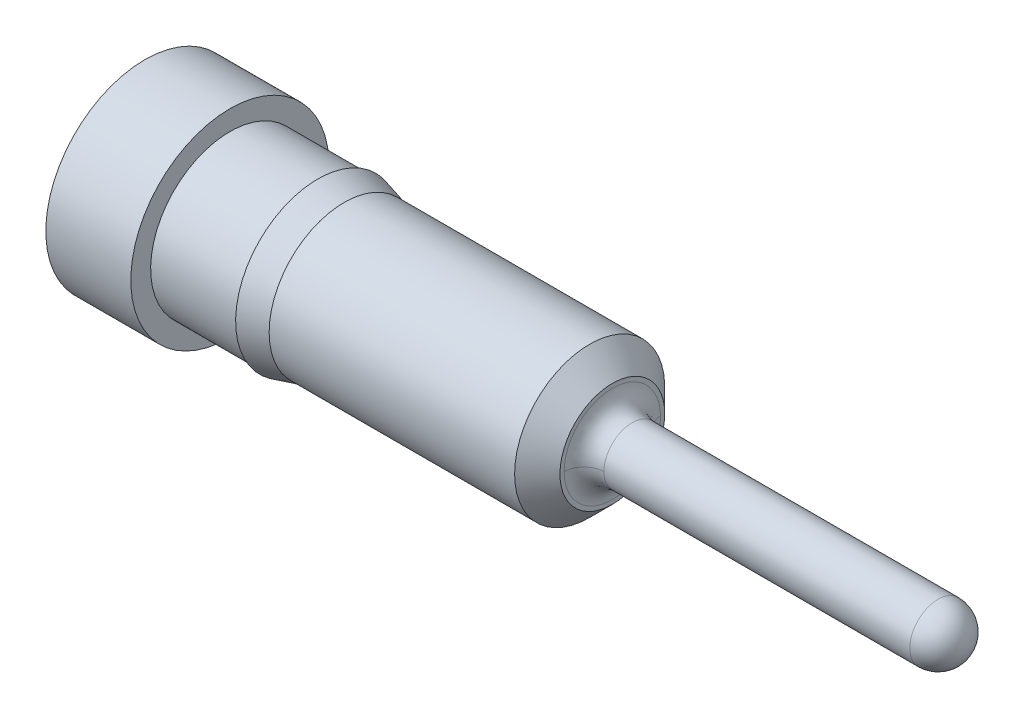
ISO-10303-21;
HEADER;
FILE_DESCRIPTION(('STEP AP214'),'2;1');
FILE_NAME('part.step','',(''),(''),'','','');
FILE_SCHEMA(('AUTOMOTIVE_DESIGN { 1 0 10303 214 1 1 1 1 }'));
ENDSEC;
DATA;
#1=APPLICATION_CONTEXT('core data for automotive mechanical design processes');
#2=APPLICATION_PROTOCOL_DEFINITION('international standard','automotive_design',2000,#1);
#3=PRODUCT_CONTEXT('',#1,'mechanical');
#4=PRODUCT('Part','Part','',(#3));
#5=PRODUCT_RELATED_PRODUCT_CATEGORY('part','',(#4));
#6=PRODUCT_DEFINITION_FORMATION('','',#4);
#7=PRODUCT_DEFINITION_CONTEXT('part definition',#1,'design');
#8=PRODUCT_DEFINITION('design','',#6,#7);
#9=PRODUCT_DEFINITION_SHAPE('','',#8);
#10=(LENGTH_UNIT() NAMED_UNIT(*) SI_UNIT(.MILLI.,.METRE.));
#11=(NAMED_UNIT(*) PLANE_ANGLE_UNIT() SI_UNIT($,.RADIAN.));
#12=(NAMED_UNIT(*) SI_UNIT($,.STERADIAN.) SOLID_ANGLE_UNIT());
#13=UNCERTAINTY_MEASURE_WITH_UNIT(LENGTH_MEASURE(1.E-05),#10,'distance_accuracy_value','');
#14=(GEOMETRIC_REPRESENTATION_CONTEXT(3) GLOBAL_UNCERTAINTY_ASSIGNED_CONTEXT((#13)) GLOBAL_UNIT_ASSIGNED_CONTEXT((#10,
#11,#12)) REPRESENTATION_CONTEXT('',''));
#15=CARTESIAN_POINT('',(0.,0.,0.));
#16=DIRECTION('',(0.,0.,1.));
#17=DIRECTION('',(1.,0.,0.));
#18=AXIS2_PLACEMENT_3D('',#15,#16,#17);
#19=CARTESIAN_POINT('',(0.,-0.899668,0.899668));
#20=DIRECTION('',(1.,0.,0.));
#21=DIRECTION('',(0.,0.,-1.));
#22=AXIS2_PLACEMENT_3D('',#19,#20,#21);
#23=PLANE('',#22);
#24=CARTESIAN_POINT('',(0.,0.,0.));
#25=DIRECTION('',(-1.,0.,0.));
#26=DIRECTION('',(0.,-1.,0.));
#27=AXIS2_PLACEMENT_3D('',#24,#25,#26);
#28=CIRCLE('',#27,0.889);
#29=CARTESIAN_POINT('',(0.,-0.889,0.));
#30=VERTEX_POINT('',#29);
#31=EDGE_CURVE('E21',#30,#30,#28,.T.);
#32=ORIENTED_EDGE('',*,*,#31,.T.);
#33=EDGE_LOOP('',(#32));
#34=FACE_BOUND('',#33,.T.);
#35=ADVANCED_FACE('F16',(#34),#23,.F.);
#36=CARTESIAN_POINT('',(0.762,0.,0.));
#37=DIRECTION('',(-1.,0.,0.));
#38=DIRECTION('',(0.,-1.,0.));
#39=AXIS2_PLACEMENT_3D('',#36,#37,#38);
#40=CYLINDRICAL_SURFACE('',#39,0.889);
#41=ORIENTED_EDGE('',*,*,#31,.F.);
#42=EDGE_LOOP('',(#41));
#43=FACE_BOUND('',#42,.T.);
#44=CARTESIAN_POINT('',(0.762,0.,0.));
#45=DIRECTION('',(-1.,0.,0.));
#46=DIRECTION('',(0.,-1.,0.));
#47=AXIS2_PLACEMENT_3D('',#44,#45,#46);
#48=CIRCLE('',#47,0.889);
#49=CARTESIAN_POINT('',(0.762,-0.889,0.));
#50=VERTEX_POINT('',#49);
#51=EDGE_CURVE('E182',#50,#50,#48,.T.);
#52=ORIENTED_EDGE('',*,*,#51,.T.);
#53=EDGE_LOOP('',(#52));
#54=FACE_BOUND('',#53,.T.);
#55=ADVANCED_FACE('F92',(#43,#54),#40,.T.);
#56=CARTESIAN_POINT('',(0.762,-0.899668,-0.899668));
#57=DIRECTION('',(-1.,0.,0.));
#58=DIRECTION('',(0.,0.,1.));
#59=AXIS2_PLACEMENT_3D('',#56,#57,#58);
#60=PLANE('',#59);
#61=CARTESIAN_POINT('',(0.762,0.,0.));
#62=DIRECTION('',(-1.,0.,0.));
#63=DIRECTION('',(0.,-1.,0.));
#64=AXIS2_PLACEMENT_3D('',#61,#62,#63);
#65=CIRCLE('',#64,0.7112);
#66=CARTESIAN_POINT('',(0.762,-0.7112,0.));
#67=VERTEX_POINT('',#66);
#68=EDGE_CURVE('E177',#67,#67,#65,.T.);
#69=ORIENTED_EDGE('',*,*,#68,.T.);
#70=EDGE_LOOP('',(#69));
#71=FACE_BOUND('',#70,.T.);
#72=ORIENTED_EDGE('',*,*,#51,.F.);
#73=EDGE_LOOP('',(#72));
#74=FACE_BOUND('',#73,.T.);
#75=ADVANCED_FACE('F90',(#71,#74),#60,.F.);
#76=CARTESIAN_POINT('',(1.5494,0.,0.));
#77=DIRECTION('',(-1.,0.,0.));
#78=DIRECTION('',(0.,-1.,0.));
#79=AXIS2_PLACEMENT_3D('',#76,#77,#78);
#80=CYLINDRICAL_SURFACE('',#79,0.7112);
#81=ORIENTED_EDGE('',*,*,#68,.F.);
#82=EDGE_LOOP('',(#81));
#83=FACE_BOUND('',#82,.T.);
#84=CARTESIAN_POINT('',(1.5494,0.,0.));
#85=DIRECTION('',(-1.,0.,0.));
#86=DIRECTION('',(0.,-1.,0.));
#87=AXIS2_PLACEMENT_3D('',#84,#85,#86);
#88=CIRCLE('',#87,0.7112);
#89=CARTESIAN_POINT('',(1.5494,-0.7112,0.));
#90=VERTEX_POINT('',#89);
#91=EDGE_CURVE('E173',#90,#90,#88,.T.);
#92=ORIENTED_EDGE('',*,*,#91,.T.);
#93=EDGE_LOOP('',(#92));
#94=FACE_BOUND('',#93,.T.);
#95=ADVANCED_FACE('F87',(#83,#94),#80,.T.);
#96=CARTESIAN_POINT('',(1.5494,-0.7454392,0.7454392));
#97=DIRECTION('',(1.,0.,0.));
#98=DIRECTION('',(0.,0.,-1.));
#99=AXIS2_PLACEMENT_3D('',#96,#97,#98);
#100=PLANE('',#99);
#101=ORIENTED_EDGE('',*,*,#91,.F.);
#102=EDGE_LOOP('',(#101));
#103=FACE_BOUND('',#102,.T.);
#104=CARTESIAN_POINT('',(1.54940000000003,0.,0.));
#105=DIRECTION('',(-1.,0.,0.));
#106=DIRECTION('',(0.,-1.,0.));
#107=AXIS2_PLACEMENT_3D('',#104,#105,#106);
#108=CIRCLE('',#107,0.736599999999991);
#109=CARTESIAN_POINT('',(1.54940000000003,-0.736599999999991,0.));
#110=VERTEX_POINT('',#109);
#111=EDGE_CURVE('E169',#110,#110,#108,.T.);
#112=ORIENTED_EDGE('',*,*,#111,.T.);
#113=EDGE_LOOP('',(#112));
#114=FACE_BOUND('',#113,.T.);
#115=ADVANCED_FACE('F85',(#103,#114),#100,.F.);
#116=CARTESIAN_POINT('',(1.7863852258,0.,0.));
#117=DIRECTION('',(-1.,0.,0.));
#118=DIRECTION('',(0.,-1.,0.));
#119=AXIS2_PLACEMENT_3D('',#116,#117,#118);
#120=CONICAL_SURFACE('',#119,0.6731,0.261799388306168);
#121=ORIENTED_EDGE('',*,*,#111,.F.);
#122=EDGE_LOOP('',(#121));
#123=FACE_BOUND('',#122,.T.);
#124=CARTESIAN_POINT('',(1.7863852258,0.,0.));
#125=DIRECTION('',(-1.,0.,0.));
#126=DIRECTION('',(0.,0.,1.));
#127=AXIS2_PLACEMENT_3D('',#124,#125,#126);
#128=CIRCLE('',#127,0.6731);
#129=CARTESIAN_POINT('',(1.7863852258,0.,0.6731));
#130=VERTEX_POINT('',#129);
#131=EDGE_CURVE('E75',#130,#130,#128,.T.);
#132=ORIENTED_EDGE('',*,*,#131,.T.);
#133=EDGE_LOOP('',(#132));
#134=FACE_BOUND('',#133,.T.);
#135=ADVANCED_FACE('F81',(#123,#134),#120,.T.);
#136=CARTESIAN_POINT('',(3.9878,0.,0.));
#137=DIRECTION('',(-1.,0.,0.));
#138=DIRECTION('',(0.,0.,1.));
#139=AXIS2_PLACEMENT_3D('',#136,#137,#138);
#140=CYLINDRICAL_SURFACE('',#139,0.6731);
#141=ORIENTED_EDGE('',*,*,#131,.F.);
#142=EDGE_LOOP('',(#141));
#143=FACE_BOUND('',#142,.T.);
#144=CARTESIAN_POINT('',(3.98779999999999,0.,0.));
#145=DIRECTION('',(-1.,0.,0.));
#146=DIRECTION('',(0.,0.,1.));
#147=AXIS2_PLACEMENT_3D('',#144,#145,#146);
#148=CIRCLE('',#147,0.6731);
#149=CARTESIAN_POINT('',(3.9878,0.,0.6731));
#150=VERTEX_POINT('',#149);
#151=EDGE_CURVE('E63',#150,#150,#148,.T.);
#152=ORIENTED_EDGE('',*,*,#151,.T.);
#153=EDGE_LOOP('',(#152));
#154=FACE_BOUND('',#153,.T.);
#155=ADVANCED_FACE('F56',(#143,#154),#140,.T.);
#156=CARTESIAN_POINT('',(7.112,0.,0.));
#157=DIRECTION('',(-1.,0.,0.));
#158=DIRECTION('',(0.,-1.,0.));
#159=AXIS2_PLACEMENT_3D('',#156,#157,#158);
#160=SPHERICAL_SURFACE('',#159,0.254);
#161=CARTESIAN_POINT('',(7.366,2.54000000000001E-09,0.));
#162=VERTEX_POINT('',#161);
#163=VERTEX_LOOP('',#162);
#164=FACE_BOUND('',#163,.T.);
#165=CARTESIAN_POINT('',(7.112,0.,0.));
#166=DIRECTION('',(-1.,0.,0.));
#167=DIRECTION('',(0.,0.,1.));
#168=AXIS2_PLACEMENT_3D('',#165,#166,#167);
#169=CIRCLE('',#168,0.254);
#170=CARTESIAN_POINT('',(7.112,0.,0.254));
#171=VERTEX_POINT('',#170);
#172=EDGE_CURVE('E60',#171,#171,#169,.F.);
#173=ORIENTED_EDGE('',*,*,#172,.T.);
#174=EDGE_LOOP('',(#173));
#175=FACE_BOUND('',#174,.T.);
#176=ADVANCED_FACE('F52',(#164,#175),#160,.T.);
#177=CARTESIAN_POINT('',(4.191,0.,0.));
#178=DIRECTION('',(-1.,0.,0.));
#179=DIRECTION('',(0.,-1.,0.));
#180=AXIS2_PLACEMENT_3D('',#177,#178,#179);
#181=CONICAL_SURFACE('',#180,0.4699,0.785398163397449);
#182=CARTESIAN_POINT('',(4.19100000000005,0.,0.));
#183=DIRECTION('',(-1.,0.,0.));
#184=DIRECTION('',(0.,-1.,0.));
#185=AXIS2_PLACEMENT_3D('',#182,#183,#184);
#186=CIRCLE('',#185,0.469899999999946);
#187=CARTESIAN_POINT('',(4.19100000000005,-0.469899999999946,0.));
#188=VERTEX_POINT('',#187);
#189=EDGE_CURVE('E62',#188,#188,#186,.T.);
#190=ORIENTED_EDGE('',*,*,#189,.T.);
#191=EDGE_LOOP('',(#190));
#192=FACE_BOUND('',#191,.T.);
#193=ORIENTED_EDGE('',*,*,#151,.F.);
#194=EDGE_LOOP('',(#193));
#195=FACE_BOUND('',#194,.T.);
#196=ADVANCED_FACE('F55',(#192,#195),#181,.T.);
#197=CARTESIAN_POINT('',(7.112,0.,0.));
#198=DIRECTION('',(-1.,0.,0.));
#199=DIRECTION('',(0.,-1.,0.));
#200=AXIS2_PLACEMENT_3D('',#197,#198,#199);
#201=CYLINDRICAL_SURFACE('',#200,0.254);
#202=ORIENTED_EDGE('',*,*,#172,.F.);
#203=EDGE_LOOP('',(#202));
#204=FACE_BOUND('',#203,.T.);
#205=CARTESIAN_POINT('',(4.3688,0.,0.));
#206=DIRECTION('',(-1.,0.,0.));
#207=DIRECTION('',(0.,0.,1.));
#208=AXIS2_PLACEMENT_3D('',#205,#206,#207);
#209=CIRCLE('',#208,0.254);
#210=CARTESIAN_POINT('',(4.36880000219067,-1.14037908104491E-11,0.25400000168551));
#211=VERTEX_POINT('',#210);
#212=CARTESIAN_POINT('',(4.36880000146045,-5.20962708428941E-11,-0.254000001685511));
#213=VERTEX_POINT('',#212);
#214=EDGE_CURVE('E44',#211,#213,#209,.T.);
#215=ORIENTED_EDGE('',*,*,#214,.F.);
#216=CARTESIAN_POINT('',(4.3688000029209,0.,0.));
#217=DIRECTION('',(1.,0.,0.));
#218=DIRECTION('',(0.,0.,-1.));
#219=AXIS2_PLACEMENT_3D('',#216,#217,#218);
#220=CIRCLE('',#219,0.254000003371021);
#221=EDGE_CURVE('E140',#211,#213,#220,.T.);
#222=ORIENTED_EDGE('',*,*,#221,.T.);
#223=EDGE_LOOP('',(#215,#222));
#224=FACE_BOUND('',#223,.T.);
#225=ADVANCED_FACE('F209',(#204,#224),#201,.T.);
#226=CARTESIAN_POINT('',(4.3865503836,0.,0.2548882634));
#227=CARTESIAN_POINT('',(4.3865503836,0.5097765268,0.2548882634));
#228=CARTESIAN_POINT('',(4.3865503836,0.5097765268,-0.2548882634));
#229=CARTESIAN_POINT('',(4.3865503836,0.,-0.2548882634));
#230=CARTESIAN_POINT('',(4.2656664496,0.,0.2427594078));
#231=CARTESIAN_POINT('',(4.2656664496,0.4855188156,0.2427594078));
#232=CARTESIAN_POINT('',(4.2656664496,0.4855188156,-0.2427594078));
#233=CARTESIAN_POINT('',(4.2656664496,0.,-0.2427594078));
#234=CARTESIAN_POINT('',(4.1797594078,0.,0.3286664496));
#235=CARTESIAN_POINT('',(4.1797594078,0.6573328738,0.3286664496));
#236=CARTESIAN_POINT('',(4.1797594078,0.6573328738,-0.3286664496));
#237=CARTESIAN_POINT('',(4.1797594078,0.,-0.3286664496));
#238=CARTESIAN_POINT('',(4.1918882634,0.,0.4495503836));
#239=CARTESIAN_POINT('',(4.1918882634,0.8991007672,0.4495503836));
#240=CARTESIAN_POINT('',(4.1918882634,0.8991007672,-0.4495503836));
#241=CARTESIAN_POINT('',(4.1918882634,0.,-0.4495503836));
#242=(BOUNDED_SURFACE() B_SPLINE_SURFACE(3,3,((#226,#227,#228,#229),(#230,#231,#232,#233),(#234,
#235,#236,#237),(#238,#239,#240,#241)),.UNSPECIFIED.,.F.,.F.,
.F.) B_SPLINE_SURFACE_WITH_KNOTS((4,4),(4,4),(0.,1.),(0.,1.),
.UNSPECIFIED.) GEOMETRIC_REPRESENTATION_ITEM() RATIONAL_B_SPLINE_SURFACE(((1.,0.333333333333333,
0.333333333333333,1.),(0.755320871117972,0.251773623705991,0.251773623705991,0.755320871117972),
(0.755320871117972,0.251773623705991,0.251773623705991,0.755320871117972),(1.,0.333333333333333,
0.333333333333333,1.))) REPRESENTATION_ITEM('') SURFACE());
#243=CARTESIAN_POINT('',(4.19100000337102,0.,-0.43180000376023));
#244=CARTESIAN_POINT('',(4.19100000337102,0.863600004185977,-0.43180000376023));
#245=CARTESIAN_POINT('',(4.19100000337102,0.863600004185977,0.43180000376023));
#246=CARTESIAN_POINT('',(4.19100000337102,0.,0.43180000376023));
#247=(BOUNDED_CURVE() B_SPLINE_CURVE(3,(#243,#244,#245,#246),.UNSPECIFIED.,.F.,
.F.) B_SPLINE_CURVE_WITH_KNOTS((4,4),(0.,1.),
.UNSPECIFIED.) CURVE() GEOMETRIC_REPRESENTATION_ITEM() RATIONAL_B_SPLINE_CURVE((0.956578304036451,
0.318859434678817,0.318859434678817,0.956578304036451)) REPRESENTATION_ITEM(''));
#248=CARTESIAN_POINT('',(4.19100000202261,0.,-0.431800002249368));
#249=VERTEX_POINT('',#248);
#250=CARTESIAN_POINT('',(4.19100000202261,0.,0.431800002249368));
#251=VERTEX_POINT('',#250);
#252=EDGE_CURVE('E33',#249,#251,#247,.T.);
#253=CARTESIAN_POINT('',(4.3865503836,0.,0.2548882634));
#254=CARTESIAN_POINT('',(4.2656664496,0.,0.2427594078));
#255=CARTESIAN_POINT('',(4.1797594078,0.,0.3286664496));
#256=CARTESIAN_POINT('',(4.1918882634,0.,0.4495503836));
#257=(BOUNDED_CURVE() B_SPLINE_CURVE(3,(#253,#254,#255,#256),.UNSPECIFIED.,.F.,
.F.) B_SPLINE_CURVE_WITH_KNOTS((4,4),(0.,1.),
.UNSPECIFIED.) CURVE() GEOMETRIC_REPRESENTATION_ITEM() RATIONAL_B_SPLINE_CURVE((1.,
0.755320871117972,0.755320871117972,1.)) REPRESENTATION_ITEM(''));
#258=EDGE_CURVE('E49',#251,#211,#257,.F.);
#259=CARTESIAN_POINT('',(4.3865503836,0.,-0.2548882634));
#260=CARTESIAN_POINT('',(4.2656664496,0.,-0.2427594078));
#261=CARTESIAN_POINT('',(4.1797594078,0.,-0.3286664496));
#262=CARTESIAN_POINT('',(4.1918882634,0.,-0.4495503836));
#263=(BOUNDED_CURVE() B_SPLINE_CURVE(3,(#259,#260,#261,#262),.UNSPECIFIED.,.F.,
.F.) B_SPLINE_CURVE_WITH_KNOTS((4,4),(0.,1.),
.UNSPECIFIED.) CURVE() GEOMETRIC_REPRESENTATION_ITEM() RATIONAL_B_SPLINE_CURVE((1.,
0.755320871117972,0.755320871117972,1.)) REPRESENTATION_ITEM(''));
#264=EDGE_CURVE('E27',#213,#249,#263,.T.);
#265=ORIENTED_EDGE('',*,*,#252,.T.);
#266=ORIENTED_EDGE('',*,*,#258,.T.);
#267=ORIENTED_EDGE('',*,*,#214,.T.);
#268=ORIENTED_EDGE('',*,*,#264,.T.);
#269=EDGE_LOOP('',(#265,#266,#267,#268));
#270=FACE_BOUND('',#269,.T.);
#271=ADVANCED_FACE('F114',(#270),#242,.F.);
#272=CARTESIAN_POINT('',(4.191,-0.4755388,-0.4755388));
#273=DIRECTION('',(-1.,0.,0.));
#274=DIRECTION('',(0.,0.,1.));
#275=AXIS2_PLACEMENT_3D('',#272,#273,#274);
#276=PLANE('',#275);
#277=CARTESIAN_POINT('',(4.19100000337102,0.,0.43180000376023));
#278=CARTESIAN_POINT('',(4.19100000337102,-0.863600004185977,0.43180000376023));
#279=CARTESIAN_POINT('',(4.19100000337102,-0.863600004185977,-0.43180000376023));
#280=CARTESIAN_POINT('',(4.19100000337102,0.,-0.43180000376023));
#281=(BOUNDED_CURVE() B_SPLINE_CURVE(3,(#277,#278,#279,#280),.UNSPECIFIED.,.F.,
.F.) B_SPLINE_CURVE_WITH_KNOTS((4,4),(0.,1.),
.UNSPECIFIED.) CURVE() GEOMETRIC_REPRESENTATION_ITEM() RATIONAL_B_SPLINE_CURVE((0.956578304036451,
0.318859434678817,0.318859434678817,0.956578304036451)) REPRESENTATION_ITEM(''));
#282=EDGE_CURVE('E10',#249,#251,#281,.F.);
#283=ORIENTED_EDGE('',*,*,#282,.T.);
#284=ORIENTED_EDGE('',*,*,#252,.F.);
#285=EDGE_LOOP('',(#283,#284));
#286=FACE_BOUND('',#285,.T.);
#287=ORIENTED_EDGE('',*,*,#189,.F.);
#288=EDGE_LOOP('',(#287));
#289=FACE_BOUND('',#288,.T.);
#290=ADVANCED_FACE('F18',(#286,#289),#276,.F.);
#291=CARTESIAN_POINT('',(4.3865503836,0.,-0.2548882634));
#292=CARTESIAN_POINT('',(4.3865503836,-0.5097765268,-0.2548882634));
#293=CARTESIAN_POINT('',(4.3865503836,-0.5097765268,0.2548882634));
#294=CARTESIAN_POINT('',(4.3865503836,0.,0.2548882634));
#295=CARTESIAN_POINT('',(4.2656664496,0.,-0.2427594078));
#296=CARTESIAN_POINT('',(4.2656664496,-0.4855188156,-0.2427594078));
#297=CARTESIAN_POINT('',(4.2656664496,-0.4855188156,0.2427594078));
#298=CARTESIAN_POINT('',(4.2656664496,0.,0.2427594078));
#299=CARTESIAN_POINT('',(4.1797594078,0.,-0.3286664496));
#300=CARTESIAN_POINT('',(4.1797594078,-0.6573328738,-0.3286664496));
#301=CARTESIAN_POINT('',(4.1797594078,-0.6573328738,0.3286664496));
#302=CARTESIAN_POINT('',(4.1797594078,0.,0.3286664496));
#303=CARTESIAN_POINT('',(4.1918882634,0.,-0.4495503836));
#304=CARTESIAN_POINT('',(4.1918882634,-0.8991007672,-0.4495503836));
#305=CARTESIAN_POINT('',(4.1918882634,-0.8991007672,0.4495503836));
#306=CARTESIAN_POINT('',(4.1918882634,0.,0.4495503836));
#307=(BOUNDED_SURFACE() B_SPLINE_SURFACE(3,3,((#291,#292,#293,#294),(#295,#296,#297,#298),(#299,
#300,#301,#302),(#303,#304,#305,#306)),.UNSPECIFIED.,.F.,.F.,
.F.) B_SPLINE_SURFACE_WITH_KNOTS((4,4),(4,4),(0.,1.),(0.,1.),
.UNSPECIFIED.) GEOMETRIC_REPRESENTATION_ITEM() RATIONAL_B_SPLINE_SURFACE(((1.,0.333333333333333,
0.333333333333333,1.),(0.755320871117972,0.251773623705991,0.251773623705991,0.755320871117972),
(0.755320871117972,0.251773623705991,0.251773623705991,0.755320871117972),(1.,0.333333333333333,
0.333333333333333,1.))) REPRESENTATION_ITEM('') SURFACE());
#308=ORIENTED_EDGE('',*,*,#264,.F.);
#309=ORIENTED_EDGE('',*,*,#221,.F.);
#310=ORIENTED_EDGE('',*,*,#258,.F.);
#311=ORIENTED_EDGE('',*,*,#282,.F.);
#312=EDGE_LOOP('',(#308,#309,#310,#311));
#313=FACE_BOUND('',#312,.T.);
#314=ADVANCED_FACE('F108',(#313),#307,.F.);
#315=CLOSED_SHELL('',(#35,#55,#75,#95,#115,#135,#155,#176,#196,#225,#271,#290,#314));
#316=MANIFOLD_SOLID_BREP('B1',#315);
#317=ADVANCED_BREP_SHAPE_REPRESENTATION('',(#18,#316),#14);
#318=SHAPE_DEFINITION_REPRESENTATION(#9,#317);
ENDSEC;
END-ISO-10303-21;
